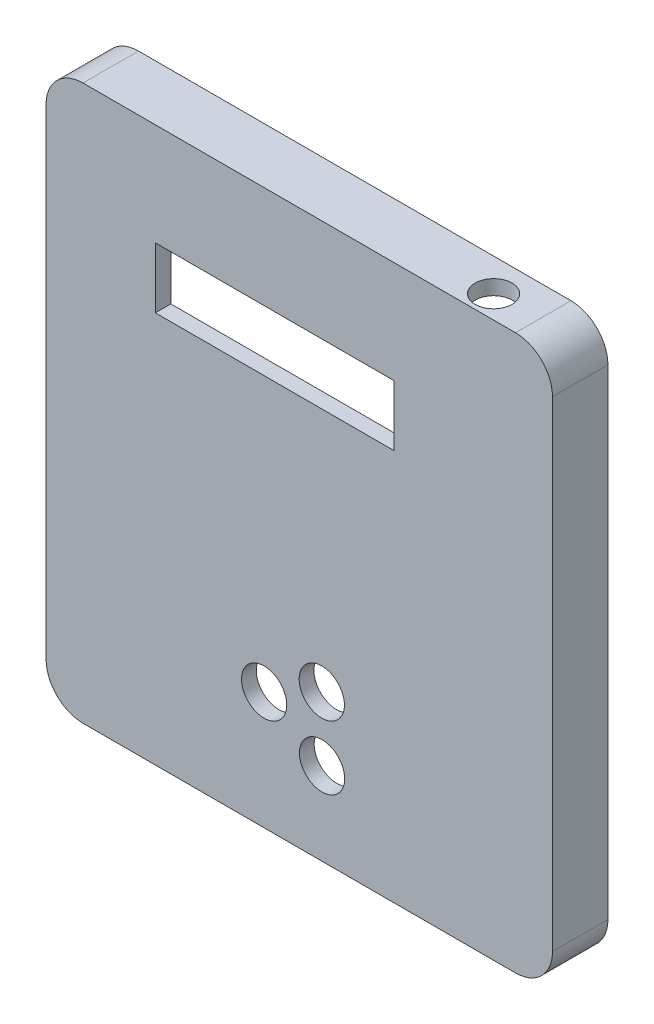
ISO-10303-21;
HEADER;
FILE_DESCRIPTION(('STEP AP214'),'2;1');
FILE_NAME('part.step','',(''),(''),'','','');
FILE_SCHEMA(('AUTOMOTIVE_DESIGN { 1 0 10303 214 1 1 1 1 }'));
ENDSEC;
DATA;
#1=APPLICATION_CONTEXT('core data for automotive mechanical design processes');
#2=APPLICATION_PROTOCOL_DEFINITION('international standard','automotive_design',2000,#1);
#3=PRODUCT_CONTEXT('',#1,'mechanical');
#4=PRODUCT('Part','Part','',(#3));
#5=PRODUCT_RELATED_PRODUCT_CATEGORY('part','',(#4));
#6=PRODUCT_DEFINITION_FORMATION('','',#4);
#7=PRODUCT_DEFINITION_CONTEXT('part definition',#1,'design');
#8=PRODUCT_DEFINITION('design','',#6,#7);
#9=PRODUCT_DEFINITION_SHAPE('','',#8);
#10=(LENGTH_UNIT() NAMED_UNIT(*) SI_UNIT(.MILLI.,.METRE.));
#11=(NAMED_UNIT(*) PLANE_ANGLE_UNIT() SI_UNIT($,.RADIAN.));
#12=(NAMED_UNIT(*) SI_UNIT($,.STERADIAN.) SOLID_ANGLE_UNIT());
#13=UNCERTAINTY_MEASURE_WITH_UNIT(LENGTH_MEASURE(1.E-05),#10,'distance_accuracy_value','');
#14=(GEOMETRIC_REPRESENTATION_CONTEXT(3) GLOBAL_UNCERTAINTY_ASSIGNED_CONTEXT((#13)) GLOBAL_UNIT_ASSIGNED_CONTEXT((#10,
#11,#12)) REPRESENTATION_CONTEXT('',''));
#15=CARTESIAN_POINT('',(0.,0.,0.));
#16=DIRECTION('',(0.,0.,1.));
#17=DIRECTION('',(1.,0.,0.));
#18=AXIS2_PLACEMENT_3D('',#15,#16,#17);
#19=CARTESIAN_POINT('',(0.,0.,0.));
#20=DIRECTION('',(0.,0.,1.));
#21=DIRECTION('',(1.,0.,0.));
#22=AXIS2_PLACEMENT_3D('',#19,#20,#21);
#23=PLANE('',#22);
#24=CARTESIAN_POINT('',(-58.5,-65.,0.));
#25=DIRECTION('',(0.,0.,1.));
#26=DIRECTION('',(1.,0.,0.));
#27=AXIS2_PLACEMENT_3D('',#24,#25,#26);
#28=CIRCLE('',#27,10.);
#29=CARTESIAN_POINT('',(-58.5,-75.,0.));
#30=VERTEX_POINT('',#29);
#31=CARTESIAN_POINT('',(-68.5,-64.9999999999999,0.));
#32=VERTEX_POINT('',#31);
#33=EDGE_CURVE('E39',#30,#32,#28,.F.);
#34=ORIENTED_EDGE('',*,*,#33,.T.);
#35=DIRECTION('',(0.,1.,0.));
#36=VECTOR('',#35,1.);
#37=CARTESIAN_POINT('',(-68.5,-64.9999999999999,0.));
#38=LINE('',#37,#36);
#39=CARTESIAN_POINT('',(-68.5,64.9999999999999,0.));
#40=VERTEX_POINT('',#39);
#41=EDGE_CURVE('E393',#32,#40,#38,.T.);
#42=ORIENTED_EDGE('',*,*,#41,.T.);
#43=CARTESIAN_POINT('',(-58.5,65.,0.));
#44=DIRECTION('',(0.,0.,1.));
#45=DIRECTION('',(1.,0.,0.));
#46=AXIS2_PLACEMENT_3D('',#43,#44,#45);
#47=CIRCLE('',#46,9.99999999999999);
#48=CARTESIAN_POINT('',(-58.5,75.,0.));
#49=VERTEX_POINT('',#48);
#50=EDGE_CURVE('E391',#40,#49,#47,.F.);
#51=ORIENTED_EDGE('',*,*,#50,.T.);
#52=DIRECTION('',(1.,0.,0.));
#53=VECTOR('',#52,1.);
#54=CARTESIAN_POINT('',(58.4999999999999,75.,0.));
#55=LINE('',#54,#53);
#56=CARTESIAN_POINT('',(58.4999999999999,75.,0.));
#57=VERTEX_POINT('',#56);
#58=EDGE_CURVE('E388',#49,#57,#55,.T.);
#59=ORIENTED_EDGE('',*,*,#58,.T.);
#60=CARTESIAN_POINT('',(58.5,65.,0.));
#61=DIRECTION('',(0.,0.,1.));
#62=DIRECTION('',(1.,0.,0.));
#63=AXIS2_PLACEMENT_3D('',#60,#61,#62);
#64=CIRCLE('',#63,9.99999999999999);
#65=CARTESIAN_POINT('',(68.5,65.,0.));
#66=VERTEX_POINT('',#65);
#67=EDGE_CURVE('E385',#57,#66,#64,.F.);
#68=ORIENTED_EDGE('',*,*,#67,.T.);
#69=DIRECTION('',(0.,-1.,0.));
#70=VECTOR('',#69,1.);
#71=CARTESIAN_POINT('',(68.5,-64.9999999999999,0.));
#72=LINE('',#71,#70);
#73=CARTESIAN_POINT('',(68.5,-65.,0.));
#74=VERTEX_POINT('',#73);
#75=EDGE_CURVE('E382',#66,#74,#72,.T.);
#76=ORIENTED_EDGE('',*,*,#75,.T.);
#77=CARTESIAN_POINT('',(58.5,-65.,0.));
#78=DIRECTION('',(0.,0.,1.));
#79=DIRECTION('',(1.,0.,0.));
#80=AXIS2_PLACEMENT_3D('',#77,#78,#79);
#81=CIRCLE('',#80,9.99999999999999);
#82=CARTESIAN_POINT('',(58.4999999999999,-75.,0.));
#83=VERTEX_POINT('',#82);
#84=EDGE_CURVE('E44',#74,#83,#81,.F.);
#85=ORIENTED_EDGE('',*,*,#84,.T.);
#86=DIRECTION('',(-1.,0.,0.));
#87=VECTOR('',#86,1.);
#88=CARTESIAN_POINT('',(58.4999999999999,-75.,0.));
#89=LINE('',#88,#87);
#90=EDGE_CURVE('E11',#83,#30,#89,.T.);
#91=ORIENTED_EDGE('',*,*,#90,.T.);
#92=EDGE_LOOP('',(#34,#42,#51,#59,#68,#76,#85,#91));
#93=FACE_BOUND('',#92,.T.);
#94=CARTESIAN_POINT('',(58.5,-65.,0.));
#95=DIRECTION('',(0.,0.,1.));
#96=DIRECTION('',(1.,0.,0.));
#97=AXIS2_PLACEMENT_3D('',#94,#95,#96);
#98=CIRCLE('',#97,5.99999999999999);
#99=CARTESIAN_POINT('',(64.5,-65.,0.));
#100=VERTEX_POINT('',#99);
#101=CARTESIAN_POINT('',(58.4999999999999,-71.,0.));
#102=VERTEX_POINT('',#101);
#103=EDGE_CURVE('E351',#100,#102,#98,.F.);
#104=ORIENTED_EDGE('',*,*,#103,.F.);
#105=DIRECTION('',(0.,-1.,0.));
#106=VECTOR('',#105,1.);
#107=CARTESIAN_POINT('',(64.5,-64.9999999999999,0.));
#108=LINE('',#107,#106);
#109=CARTESIAN_POINT('',(64.5,65.,0.));
#110=VERTEX_POINT('',#109);
#111=EDGE_CURVE('E367',#110,#100,#108,.T.);
#112=ORIENTED_EDGE('',*,*,#111,.F.);
#113=CARTESIAN_POINT('',(58.5,65.,0.));
#114=DIRECTION('',(0.,0.,1.));
#115=DIRECTION('',(1.,0.,0.));
#116=AXIS2_PLACEMENT_3D('',#113,#114,#115);
#117=CIRCLE('',#116,5.99999999999999);
#118=CARTESIAN_POINT('',(58.5,71.,0.));
#119=VERTEX_POINT('',#118);
#120=EDGE_CURVE('E369',#119,#110,#117,.F.);
#121=ORIENTED_EDGE('',*,*,#120,.F.);
#122=DIRECTION('',(1.,0.,0.));
#123=VECTOR('',#122,1.);
#124=CARTESIAN_POINT('',(58.4999999999999,71.,0.));
#125=LINE('',#124,#123);
#126=CARTESIAN_POINT('',(-58.5,71.,0.));
#127=VERTEX_POINT('',#126);
#128=EDGE_CURVE('E371',#127,#119,#125,.T.);
#129=ORIENTED_EDGE('',*,*,#128,.F.);
#130=CARTESIAN_POINT('',(-58.5,65.,0.));
#131=DIRECTION('',(0.,0.,1.));
#132=DIRECTION('',(1.,0.,0.));
#133=AXIS2_PLACEMENT_3D('',#130,#131,#132);
#134=CIRCLE('',#133,5.99999999999999);
#135=CARTESIAN_POINT('',(-64.5,65.,0.));
#136=VERTEX_POINT('',#135);
#137=EDGE_CURVE('E373',#136,#127,#134,.F.);
#138=ORIENTED_EDGE('',*,*,#137,.F.);
#139=DIRECTION('',(0.,1.,0.));
#140=VECTOR('',#139,1.);
#141=CARTESIAN_POINT('',(-64.5,-64.9999999999999,0.));
#142=LINE('',#141,#140);
#143=CARTESIAN_POINT('',(-64.5,-64.9999999999999,0.));
#144=VERTEX_POINT('',#143);
#145=EDGE_CURVE('E375',#144,#136,#142,.T.);
#146=ORIENTED_EDGE('',*,*,#145,.F.);
#147=CARTESIAN_POINT('',(-58.5,-65.,0.));
#148=DIRECTION('',(0.,0.,1.));
#149=DIRECTION('',(1.,0.,0.));
#150=AXIS2_PLACEMENT_3D('',#147,#148,#149);
#151=CIRCLE('',#150,6.00000000000001);
#152=CARTESIAN_POINT('',(-58.5,-71.,0.));
#153=VERTEX_POINT('',#152);
#154=EDGE_CURVE('E377',#153,#144,#151,.F.);
#155=ORIENTED_EDGE('',*,*,#154,.F.);
#156=DIRECTION('',(-1.,0.,0.));
#157=VECTOR('',#156,1.);
#158=CARTESIAN_POINT('',(58.4999999999999,-71.,0.));
#159=LINE('',#158,#157);
#160=EDGE_CURVE('E379',#102,#153,#159,.T.);
#161=ORIENTED_EDGE('',*,*,#160,.F.);
#162=EDGE_LOOP('',(#104,#112,#121,#129,#138,#146,#155,#161));
#163=FACE_BOUND('',#162,.T.);
#164=ADVANCED_FACE('F36',(#93,#163),#23,.F.);
#165=CARTESIAN_POINT('',(-6.686,39.143,10.825));
#166=DIRECTION('',(0.,0.,1.));
#167=DIRECTION('',(1.,0.,0.));
#168=AXIS2_PLACEMENT_3D('',#165,#166,#167);
#169=PLANE('',#168);
#170=DIRECTION('',(0.,1.,0.));
#171=VECTOR('',#170,1.);
#172=CARTESIAN_POINT('',(-42.936,47.343,10.825));
#173=LINE('',#172,#171);
#174=CARTESIAN_POINT('',(-42.936,26.943,10.825));
#175=VERTEX_POINT('',#174);
#176=CARTESIAN_POINT('',(-42.936,51.343,10.825));
#177=VERTEX_POINT('',#176);
#178=EDGE_CURVE('E285',#175,#177,#173,.T.);
#179=ORIENTED_EDGE('',*,*,#178,.T.);
#180=DIRECTION('',(1.,0.,0.));
#181=VECTOR('',#180,1.);
#182=CARTESIAN_POINT('',(-38.936,51.343,10.825));
#183=LINE('',#182,#181);
#184=CARTESIAN_POINT('',(29.564,51.343,10.825));
#185=VERTEX_POINT('',#184);
#186=EDGE_CURVE('E288',#177,#185,#183,.T.);
#187=ORIENTED_EDGE('',*,*,#186,.T.);
#188=DIRECTION('',(0.,-1.,0.));
#189=VECTOR('',#188,1.);
#190=CARTESIAN_POINT('',(29.564,47.343,10.825));
#191=LINE('',#190,#189);
#192=CARTESIAN_POINT('',(29.564,26.943,10.825));
#193=VERTEX_POINT('',#192);
#194=EDGE_CURVE('E278',#185,#193,#191,.T.);
#195=ORIENTED_EDGE('',*,*,#194,.T.);
#196=DIRECTION('',(-1.,0.,0.));
#197=VECTOR('',#196,1.);
#198=CARTESIAN_POINT('',(-38.936,26.943,10.825));
#199=LINE('',#198,#197);
#200=EDGE_CURVE('E287',#193,#175,#199,.T.);
#201=ORIENTED_EDGE('',*,*,#200,.T.);
#202=EDGE_LOOP('',(#179,#187,#195,#201));
#203=FACE_BOUND('',#202,.T.);
#204=DIRECTION('',(-1.,0.,0.));
#205=VECTOR('',#204,1.);
#206=CARTESIAN_POINT('',(-38.936,30.943,10.825));
#207=LINE('',#206,#205);
#208=CARTESIAN_POINT('',(25.564,30.943,10.825));
#209=VERTEX_POINT('',#208);
#210=CARTESIAN_POINT('',(-38.936,30.943,10.825));
#211=VERTEX_POINT('',#210);
#212=EDGE_CURVE('E302',#209,#211,#207,.T.);
#213=ORIENTED_EDGE('',*,*,#212,.F.);
#214=DIRECTION('',(0.,-1.,0.));
#215=VECTOR('',#214,1.);
#216=CARTESIAN_POINT('',(25.564,47.343,10.825));
#217=LINE('',#216,#215);
#218=CARTESIAN_POINT('',(25.564,47.343,10.825));
#219=VERTEX_POINT('',#218);
#220=EDGE_CURVE('E292',#219,#209,#217,.T.);
#221=ORIENTED_EDGE('',*,*,#220,.F.);
#222=DIRECTION('',(1.,0.,0.));
#223=VECTOR('',#222,1.);
#224=CARTESIAN_POINT('',(-38.936,47.343,10.825));
#225=LINE('',#224,#223);
#226=CARTESIAN_POINT('',(-38.936,47.343,10.825));
#227=VERTEX_POINT('',#226);
#228=EDGE_CURVE('E295',#227,#219,#225,.T.);
#229=ORIENTED_EDGE('',*,*,#228,.F.);
#230=DIRECTION('',(0.,1.,0.));
#231=VECTOR('',#230,1.);
#232=CARTESIAN_POINT('',(-38.936,47.343,10.825));
#233=LINE('',#232,#231);
#234=EDGE_CURVE('E299',#211,#227,#233,.T.);
#235=ORIENTED_EDGE('',*,*,#234,.F.);
#236=EDGE_LOOP('',(#213,#221,#229,#235));
#237=FACE_BOUND('',#236,.T.);
#238=ADVANCED_FACE('F436',(#203,#237),#169,.F.);
#239=CARTESIAN_POINT('',(25.564,47.343,-55.7273102529131));
#240=DIRECTION('',(1.,0.,0.));
#241=DIRECTION('',(0.,0.,-1.));
#242=AXIS2_PLACEMENT_3D('',#239,#240,#241);
#243=PLANE('',#242);
#244=ORIENTED_EDGE('',*,*,#220,.T.);
#245=DIRECTION('',(0.,0.,1.));
#246=VECTOR('',#245,1.);
#247=CARTESIAN_POINT('',(25.564,30.943,-55.7273102529131));
#248=LINE('',#247,#246);
#249=CARTESIAN_POINT('',(25.564,30.943,15.));
#250=VERTEX_POINT('',#249);
#251=EDGE_CURVE('E318',#209,#250,#248,.T.);
#252=ORIENTED_EDGE('',*,*,#251,.T.);
#253=DIRECTION('',(0.,1.,0.));
#254=VECTOR('',#253,1.);
#255=CARTESIAN_POINT('',(25.564,47.343,15.));
#256=LINE('',#255,#254);
#257=CARTESIAN_POINT('',(25.564,47.343,15.));
#258=VERTEX_POINT('',#257);
#259=EDGE_CURVE('E308',#250,#258,#256,.T.);
#260=ORIENTED_EDGE('',*,*,#259,.T.);
#261=DIRECTION('',(0.,0.,1.));
#262=VECTOR('',#261,1.);
#263=CARTESIAN_POINT('',(25.564,47.343,-55.7273102529131));
#264=LINE('',#263,#262);
#265=EDGE_CURVE('E316',#219,#258,#264,.T.);
#266=ORIENTED_EDGE('',*,*,#265,.F.);
#267=EDGE_LOOP('',(#244,#252,#260,#266));
#268=FACE_BOUND('',#267,.T.);
#269=ADVANCED_FACE('F440',(#268),#243,.F.);
#270=CARTESIAN_POINT('',(-38.936,47.343,-55.7273102529131));
#271=DIRECTION('',(0.,1.,0.));
#272=DIRECTION('',(0.,0.,1.));
#273=AXIS2_PLACEMENT_3D('',#270,#271,#272);
#274=PLANE('',#273);
#275=ORIENTED_EDGE('',*,*,#228,.T.);
#276=ORIENTED_EDGE('',*,*,#265,.T.);
#277=DIRECTION('',(-1.,0.,0.));
#278=VECTOR('',#277,1.);
#279=CARTESIAN_POINT('',(-38.936,47.343,15.));
#280=LINE('',#279,#278);
#281=CARTESIAN_POINT('',(-38.936,47.343,15.));
#282=VERTEX_POINT('',#281);
#283=EDGE_CURVE('E311',#258,#282,#280,.T.);
#284=ORIENTED_EDGE('',*,*,#283,.T.);
#285=DIRECTION('',(0.,0.,1.));
#286=VECTOR('',#285,1.);
#287=CARTESIAN_POINT('',(-38.936,47.343,-55.7273102529131));
#288=LINE('',#287,#286);
#289=EDGE_CURVE('E296',#227,#282,#288,.T.);
#290=ORIENTED_EDGE('',*,*,#289,.F.);
#291=EDGE_LOOP('',(#275,#276,#284,#290));
#292=FACE_BOUND('',#291,.T.);
#293=ADVANCED_FACE('F446',(#292),#274,.F.);
#294=CARTESIAN_POINT('',(-38.936,47.343,-55.7273102529131));
#295=DIRECTION('',(-1.,0.,0.));
#296=DIRECTION('',(0.,0.,1.));
#297=AXIS2_PLACEMENT_3D('',#294,#295,#296);
#298=PLANE('',#297);
#299=ORIENTED_EDGE('',*,*,#234,.T.);
#300=ORIENTED_EDGE('',*,*,#289,.T.);
#301=DIRECTION('',(0.,-1.,0.));
#302=VECTOR('',#301,1.);
#303=CARTESIAN_POINT('',(-38.936,47.343,15.));
#304=LINE('',#303,#302);
#305=CARTESIAN_POINT('',(-38.936,30.943,15.));
#306=VERTEX_POINT('',#305);
#307=EDGE_CURVE('E303',#282,#306,#304,.T.);
#308=ORIENTED_EDGE('',*,*,#307,.T.);
#309=DIRECTION('',(0.,0.,1.));
#310=VECTOR('',#309,1.);
#311=CARTESIAN_POINT('',(-38.936,30.943,-55.7273102529131));
#312=LINE('',#311,#310);
#313=EDGE_CURVE('E314',#211,#306,#312,.T.);
#314=ORIENTED_EDGE('',*,*,#313,.F.);
#315=EDGE_LOOP('',(#299,#300,#308,#314));
#316=FACE_BOUND('',#315,.T.);
#317=ADVANCED_FACE('F503',(#316),#298,.F.);
#318=CARTESIAN_POINT('',(-38.936,30.943,-55.7273102529131));
#319=DIRECTION('',(0.,-1.,0.));
#320=DIRECTION('',(0.,0.,-1.));
#321=AXIS2_PLACEMENT_3D('',#318,#319,#320);
#322=PLANE('',#321);
#323=ORIENTED_EDGE('',*,*,#212,.T.);
#324=ORIENTED_EDGE('',*,*,#313,.T.);
#325=DIRECTION('',(1.,0.,0.));
#326=VECTOR('',#325,1.);
#327=CARTESIAN_POINT('',(-38.936,30.943,15.));
#328=LINE('',#327,#326);
#329=EDGE_CURVE('E305',#306,#250,#328,.T.);
#330=ORIENTED_EDGE('',*,*,#329,.T.);
#331=ORIENTED_EDGE('',*,*,#251,.F.);
#332=EDGE_LOOP('',(#323,#324,#330,#331));
#333=FACE_BOUND('',#332,.T.);
#334=ADVANCED_FACE('F506',(#333),#322,.F.);
#335=CARTESIAN_POINT('',(46.3962,71.,8.825));
#336=DIRECTION('',(0.,1.,0.));
#337=DIRECTION('',(-1.,0.,0.));
#338=AXIS2_PLACEMENT_3D('',#335,#336,#337);
#339=PLANE('',#338);
#340=CARTESIAN_POINT('',(46.3962,71.,8.825));
#341=DIRECTION('',(0.,1.,0.));
#342=DIRECTION('',(-1.,0.,0.));
#343=AXIS2_PLACEMENT_3D('',#340,#341,#342);
#344=CIRCLE('',#343,5.);
#345=CARTESIAN_POINT('',(41.8940477369151,71.,11.));
#346=VERTEX_POINT('',#345);
#347=CARTESIAN_POINT('',(50.8983522630848,71.,11.));
#348=VERTEX_POINT('',#347);
#349=EDGE_CURVE('E203',#346,#348,#344,.T.);
#350=ORIENTED_EDGE('',*,*,#349,.T.);
#351=DIRECTION('',(-1.,0.,0.));
#352=VECTOR('',#351,1.);
#353=CARTESIAN_POINT('',(58.4999999999999,71.,11.));
#354=LINE('',#353,#352);
#355=EDGE_CURVE('E200',#348,#346,#354,.T.);
#356=ORIENTED_EDGE('',*,*,#355,.T.);
#357=EDGE_LOOP('',(#350,#356));
#358=FACE_BOUND('',#357,.T.);
#359=ADVANCED_FACE('F202',(#358),#339,.T.);
#360=CARTESIAN_POINT('',(-42.936,47.343,-55.7273102529131));
#361=DIRECTION('',(-1.,0.,0.));
#362=DIRECTION('',(0.,0.,1.));
#363=AXIS2_PLACEMENT_3D('',#360,#361,#362);
#364=PLANE('',#363);
#365=ORIENTED_EDGE('',*,*,#178,.F.);
#366=DIRECTION('',(0.,0.,1.));
#367=VECTOR('',#366,1.);
#368=CARTESIAN_POINT('',(-42.936,26.943,-55.7273102529131));
#369=LINE('',#368,#367);
#370=CARTESIAN_POINT('',(-42.936,26.943,11.));
#371=VERTEX_POINT('',#370);
#372=EDGE_CURVE('E273',#175,#371,#369,.T.);
#373=ORIENTED_EDGE('',*,*,#372,.T.);
#374=DIRECTION('',(0.,-1.,0.));
#375=VECTOR('',#374,1.);
#376=CARTESIAN_POINT('',(-42.936,47.343,11.));
#377=LINE('',#376,#375);
#378=CARTESIAN_POINT('',(-42.936,51.343,11.));
#379=VERTEX_POINT('',#378);
#380=EDGE_CURVE('E217',#379,#371,#377,.T.);
#381=ORIENTED_EDGE('',*,*,#380,.F.);
#382=DIRECTION('',(0.,0.,1.));
#383=VECTOR('',#382,1.);
#384=CARTESIAN_POINT('',(-42.936,51.343,-55.7273102529131));
#385=LINE('',#384,#383);
#386=EDGE_CURVE('E276',#177,#379,#385,.T.);
#387=ORIENTED_EDGE('',*,*,#386,.F.);
#388=EDGE_LOOP('',(#365,#373,#381,#387));
#389=FACE_BOUND('',#388,.T.);
#390=ADVANCED_FACE('F485',(#389),#364,.T.);
#391=CARTESIAN_POINT('',(-38.936,51.343,-55.7273102529131));
#392=DIRECTION('',(0.,1.,0.));
#393=DIRECTION('',(0.,0.,1.));
#394=AXIS2_PLACEMENT_3D('',#391,#392,#393);
#395=PLANE('',#394);
#396=ORIENTED_EDGE('',*,*,#186,.F.);
#397=ORIENTED_EDGE('',*,*,#386,.T.);
#398=DIRECTION('',(-1.,0.,0.));
#399=VECTOR('',#398,1.);
#400=CARTESIAN_POINT('',(-38.936,51.343,11.));
#401=LINE('',#400,#399);
#402=CARTESIAN_POINT('',(29.564,51.343,11.));
#403=VERTEX_POINT('',#402);
#404=EDGE_CURVE('E270',#403,#379,#401,.T.);
#405=ORIENTED_EDGE('',*,*,#404,.F.);
#406=DIRECTION('',(0.,0.,1.));
#407=VECTOR('',#406,1.);
#408=CARTESIAN_POINT('',(29.564,51.343,-55.7273102529131));
#409=LINE('',#408,#407);
#410=EDGE_CURVE('E279',#185,#403,#409,.T.);
#411=ORIENTED_EDGE('',*,*,#410,.F.);
#412=EDGE_LOOP('',(#396,#397,#405,#411));
#413=FACE_BOUND('',#412,.T.);
#414=ADVANCED_FACE('F488',(#413),#395,.T.);
#415=CARTESIAN_POINT('',(29.564,47.343,-55.7273102529131));
#416=DIRECTION('',(1.,0.,0.));
#417=DIRECTION('',(0.,0.,-1.));
#418=AXIS2_PLACEMENT_3D('',#415,#416,#417);
#419=PLANE('',#418);
#420=ORIENTED_EDGE('',*,*,#194,.F.);
#421=ORIENTED_EDGE('',*,*,#410,.T.);
#422=DIRECTION('',(0.,1.,0.));
#423=VECTOR('',#422,1.);
#424=CARTESIAN_POINT('',(29.564,47.343,11.));
#425=LINE('',#424,#423);
#426=CARTESIAN_POINT('',(29.564,26.943,11.));
#427=VERTEX_POINT('',#426);
#428=EDGE_CURVE('E268',#427,#403,#425,.T.);
#429=ORIENTED_EDGE('',*,*,#428,.F.);
#430=DIRECTION('',(0.,0.,1.));
#431=VECTOR('',#430,1.);
#432=CARTESIAN_POINT('',(29.564,26.943,-55.7273102529131));
#433=LINE('',#432,#431);
#434=EDGE_CURVE('E282',#193,#427,#433,.T.);
#435=ORIENTED_EDGE('',*,*,#434,.F.);
#436=EDGE_LOOP('',(#420,#421,#429,#435));
#437=FACE_BOUND('',#436,.T.);
#438=ADVANCED_FACE('F492',(#437),#419,.T.);
#439=CARTESIAN_POINT('',(-38.936,26.943,-55.7273102529131));
#440=DIRECTION('',(0.,-1.,0.));
#441=DIRECTION('',(0.,0.,-1.));
#442=AXIS2_PLACEMENT_3D('',#439,#440,#441);
#443=PLANE('',#442);
#444=ORIENTED_EDGE('',*,*,#200,.F.);
#445=ORIENTED_EDGE('',*,*,#434,.T.);
#446=DIRECTION('',(1.,0.,0.));
#447=VECTOR('',#446,1.);
#448=CARTESIAN_POINT('',(-38.936,26.943,11.));
#449=LINE('',#448,#447);
#450=EDGE_CURVE('E265',#371,#427,#449,.T.);
#451=ORIENTED_EDGE('',*,*,#450,.F.);
#452=ORIENTED_EDGE('',*,*,#372,.F.);
#453=EDGE_LOOP('',(#444,#445,#451,#452));
#454=FACE_BOUND('',#453,.T.);
#455=ADVANCED_FACE('F496',(#454),#443,.T.);
#456=CARTESIAN_POINT('',(6.0878,-35.3806,11.));
#457=DIRECTION('',(0.,0.,1.));
#458=DIRECTION('',(1.,0.,0.));
#459=AXIS2_PLACEMENT_3D('',#456,#457,#458);
#460=CYLINDRICAL_SURFACE('',#459,6.125);
#461=CARTESIAN_POINT('',(6.0878,-35.3806,11.));
#462=DIRECTION('',(0.,0.,1.));
#463=DIRECTION('',(1.,0.,0.));
#464=AXIS2_PLACEMENT_3D('',#461,#462,#463);
#465=CIRCLE('',#464,6.125);
#466=CARTESIAN_POINT('',(12.2128,-35.3806,11.));
#467=VERTEX_POINT('',#466);
#468=EDGE_CURVE('E722',#467,#467,#465,.T.);
#469=ORIENTED_EDGE('',*,*,#468,.F.);
#470=EDGE_LOOP('',(#469));
#471=FACE_BOUND('',#470,.T.);
#472=CARTESIAN_POINT('',(6.0878,-35.3806,15.));
#473=DIRECTION('',(0.,0.,1.));
#474=DIRECTION('',(1.,0.,0.));
#475=AXIS2_PLACEMENT_3D('',#472,#473,#474);
#476=CIRCLE('',#475,6.125);
#477=CARTESIAN_POINT('',(12.2128,-35.3806,15.));
#478=VERTEX_POINT('',#477);
#479=EDGE_CURVE('E725',#478,#478,#476,.T.);
#480=ORIENTED_EDGE('',*,*,#479,.T.);
#481=EDGE_LOOP('',(#480));
#482=FACE_BOUND('',#481,.T.);
#483=ADVANCED_FACE('F500',(#471,#482),#460,.F.);
#484=CARTESIAN_POINT('',(-9.5144,-43.1896,11.));
#485=DIRECTION('',(0.,0.,1.));
#486=DIRECTION('',(1.,0.,0.));
#487=AXIS2_PLACEMENT_3D('',#484,#485,#486);
#488=CYLINDRICAL_SURFACE('',#487,6.125);
#489=CARTESIAN_POINT('',(-9.5144,-43.1896,11.));
#490=DIRECTION('',(0.,0.,1.));
#491=DIRECTION('',(1.,0.,0.));
#492=AXIS2_PLACEMENT_3D('',#489,#490,#491);
#493=CIRCLE('',#492,6.125);
#494=CARTESIAN_POINT('',(-3.3894,-43.1896,11.));
#495=VERTEX_POINT('',#494);
#496=EDGE_CURVE('E727',#495,#495,#493,.T.);
#497=ORIENTED_EDGE('',*,*,#496,.F.);
#498=EDGE_LOOP('',(#497));
#499=FACE_BOUND('',#498,.T.);
#500=CARTESIAN_POINT('',(-9.5144,-43.1896,15.));
#501=DIRECTION('',(0.,0.,1.));
#502=DIRECTION('',(1.,0.,0.));
#503=AXIS2_PLACEMENT_3D('',#500,#501,#502);
#504=CIRCLE('',#503,6.125);
#505=CARTESIAN_POINT('',(-3.3894,-43.1896,15.));
#506=VERTEX_POINT('',#505);
#507=EDGE_CURVE('E731',#506,#506,#504,.T.);
#508=ORIENTED_EDGE('',*,*,#507,.T.);
#509=EDGE_LOOP('',(#508));
#510=FACE_BOUND('',#509,.T.);
#511=ADVANCED_FACE('F638',(#499,#510),#488,.F.);
#512=CARTESIAN_POINT('',(6.16099999999999,-52.6348,11.));
#513=DIRECTION('',(0.,0.,1.));
#514=DIRECTION('',(1.,0.,0.));
#515=AXIS2_PLACEMENT_3D('',#512,#513,#514);
#516=CYLINDRICAL_SURFACE('',#515,6.125);
#517=CARTESIAN_POINT('',(6.16099999999999,-52.6348,11.));
#518=DIRECTION('',(0.,0.,1.));
#519=DIRECTION('',(1.,0.,0.));
#520=AXIS2_PLACEMENT_3D('',#517,#518,#519);
#521=CIRCLE('',#520,6.125);
#522=CARTESIAN_POINT('',(12.286,-52.6348,11.));
#523=VERTEX_POINT('',#522);
#524=EDGE_CURVE('E760',#523,#523,#521,.T.);
#525=ORIENTED_EDGE('',*,*,#524,.F.);
#526=EDGE_LOOP('',(#525));
#527=FACE_BOUND('',#526,.T.);
#528=CARTESIAN_POINT('',(6.16099999999999,-52.6348,15.));
#529=DIRECTION('',(0.,0.,1.));
#530=DIRECTION('',(1.,0.,0.));
#531=AXIS2_PLACEMENT_3D('',#528,#529,#530);
#532=CIRCLE('',#531,6.125);
#533=CARTESIAN_POINT('',(12.286,-52.6348,15.));
#534=VERTEX_POINT('',#533);
#535=EDGE_CURVE('E757',#534,#534,#532,.T.);
#536=ORIENTED_EDGE('',*,*,#535,.T.);
#537=EDGE_LOOP('',(#536));
#538=FACE_BOUND('',#537,.T.);
#539=ADVANCED_FACE('F518',(#527,#538),#516,.F.);
#540=CARTESIAN_POINT('',(-68.5,-64.9999999999999,-25.));
#541=DIRECTION('',(-1.,0.,0.));
#542=DIRECTION('',(0.,0.,1.));
#543=AXIS2_PLACEMENT_3D('',#540,#541,#542);
#544=PLANE('',#543);
#545=ORIENTED_EDGE('',*,*,#41,.F.);
#546=DIRECTION('',(0.,0.,1.));
#547=VECTOR('',#546,1.);
#548=CARTESIAN_POINT('',(-68.5,-64.9999999999999,-25.));
#549=LINE('',#548,#547);
#550=CARTESIAN_POINT('',(-68.5,-64.9999999999999,15.));
#551=VERTEX_POINT('',#550);
#552=EDGE_CURVE('E349',#32,#551,#549,.T.);
#553=ORIENTED_EDGE('',*,*,#552,.T.);
#554=DIRECTION('',(0.,-1.,0.));
#555=VECTOR('',#554,1.);
#556=CARTESIAN_POINT('',(-68.5,-64.9999999999999,15.));
#557=LINE('',#556,#555);
#558=CARTESIAN_POINT('',(-68.5,64.9999999999999,15.));
#559=VERTEX_POINT('',#558);
#560=EDGE_CURVE('E345',#559,#551,#557,.T.);
#561=ORIENTED_EDGE('',*,*,#560,.F.);
#562=DIRECTION('',(0.,0.,1.));
#563=VECTOR('',#562,1.);
#564=CARTESIAN_POINT('',(-68.5,64.9999999999999,-25.));
#565=LINE('',#564,#563);
#566=EDGE_CURVE('E352',#40,#559,#565,.T.);
#567=ORIENTED_EDGE('',*,*,#566,.F.);
#568=EDGE_LOOP('',(#545,#553,#561,#567));
#569=FACE_BOUND('',#568,.T.);
#570=ADVANCED_FACE('F403',(#569),#544,.T.);
#571=CARTESIAN_POINT('',(-58.5,-65.,-25.));
#572=DIRECTION('',(0.,0.,1.));
#573=DIRECTION('',(1.,0.,0.));
#574=AXIS2_PLACEMENT_3D('',#571,#572,#573);
#575=CYLINDRICAL_SURFACE('',#574,6.00000000000001);
#576=DIRECTION('',(0.,0.,1.));
#577=VECTOR('',#576,1.);
#578=CARTESIAN_POINT('',(-58.5,-71.,-25.));
#579=LINE('',#578,#577);
#580=CARTESIAN_POINT('',(-58.5,-71.,11.));
#581=VERTEX_POINT('',#580);
#582=EDGE_CURVE('E241',#153,#581,#579,.T.);
#583=ORIENTED_EDGE('',*,*,#582,.F.);
#584=ORIENTED_EDGE('',*,*,#154,.T.);
#585=DIRECTION('',(0.,0.,1.));
#586=VECTOR('',#585,1.);
#587=CARTESIAN_POINT('',(-64.5,-64.9999999999999,-25.));
#588=LINE('',#587,#586);
#589=CARTESIAN_POINT('',(-64.5,-64.9999999999999,11.));
#590=VERTEX_POINT('',#589);
#591=EDGE_CURVE('E247',#144,#590,#588,.T.);
#592=ORIENTED_EDGE('',*,*,#591,.T.);
#593=CARTESIAN_POINT('',(-58.5,-65.,11.));
#594=DIRECTION('',(0.,0.,-1.));
#595=DIRECTION('',(-1.,0.,0.));
#596=AXIS2_PLACEMENT_3D('',#593,#594,#595);
#597=CIRCLE('',#596,6.00000000000001);
#598=EDGE_CURVE('E264',#590,#581,#597,.F.);
#599=ORIENTED_EDGE('',*,*,#598,.T.);
#600=EDGE_LOOP('',(#583,#584,#592,#599));
#601=FACE_BOUND('',#600,.T.);
#602=ADVANCED_FACE('F453',(#601),#575,.F.);
#603=CARTESIAN_POINT('',(-64.5,-64.9999999999999,-25.));
#604=DIRECTION('',(-1.,0.,0.));
#605=DIRECTION('',(0.,0.,1.));
#606=AXIS2_PLACEMENT_3D('',#603,#604,#605);
#607=PLANE('',#606);
#608=ORIENTED_EDGE('',*,*,#591,.F.);
#609=ORIENTED_EDGE('',*,*,#145,.T.);
#610=DIRECTION('',(0.,0.,1.));
#611=VECTOR('',#610,1.);
#612=CARTESIAN_POINT('',(-64.5,65.,-25.));
#613=LINE('',#612,#611);
#614=CARTESIAN_POINT('',(-64.5,65.,11.));
#615=VERTEX_POINT('',#614);
#616=EDGE_CURVE('E244',#136,#615,#613,.T.);
#617=ORIENTED_EDGE('',*,*,#616,.T.);
#618=DIRECTION('',(0.,-1.,0.));
#619=VECTOR('',#618,1.);
#620=CARTESIAN_POINT('',(-64.5,-64.9999999999999,11.));
#621=LINE('',#620,#619);
#622=EDGE_CURVE('E236',#615,#590,#621,.T.);
#623=ORIENTED_EDGE('',*,*,#622,.T.);
#624=EDGE_LOOP('',(#608,#609,#617,#623));
#625=FACE_BOUND('',#624,.T.);
#626=ADVANCED_FACE('F456',(#625),#607,.F.);
#627=CARTESIAN_POINT('',(46.3962,71.,8.825));
#628=DIRECTION('',(0.,1.,0.));
#629=DIRECTION('',(-1.,0.,0.));
#630=AXIS2_PLACEMENT_3D('',#627,#628,#629);
#631=CYLINDRICAL_SURFACE('',#630,5.);
#632=ORIENTED_EDGE('',*,*,#349,.F.);
#633=EDGE_CURVE('E216',#348,#346,#344,.T.);
#634=ORIENTED_EDGE('',*,*,#633,.F.);
#635=EDGE_LOOP('',(#632,#634));
#636=FACE_BOUND('',#635,.T.);
#637=CARTESIAN_POINT('',(46.3962,75.,8.825));
#638=DIRECTION('',(0.,1.,0.));
#639=DIRECTION('',(-1.,0.,0.));
#640=AXIS2_PLACEMENT_3D('',#637,#638,#639);
#641=CIRCLE('',#640,5.);
#642=CARTESIAN_POINT('',(41.3962,75.,8.825));
#643=VERTEX_POINT('',#642);
#644=EDGE_CURVE('E224',#643,#643,#641,.T.);
#645=ORIENTED_EDGE('',*,*,#644,.T.);
#646=EDGE_LOOP('',(#645));
#647=FACE_BOUND('',#646,.T.);
#648=ADVANCED_FACE('F214',(#636,#647),#631,.F.);
#649=CARTESIAN_POINT('',(-58.5,65.,-25.));
#650=DIRECTION('',(0.,0.,1.));
#651=DIRECTION('',(1.,0.,0.));
#652=AXIS2_PLACEMENT_3D('',#649,#650,#651);
#653=CYLINDRICAL_SURFACE('',#652,5.99999999999999);
#654=ORIENTED_EDGE('',*,*,#616,.F.);
#655=ORIENTED_EDGE('',*,*,#137,.T.);
#656=DIRECTION('',(0.,0.,1.));
#657=VECTOR('',#656,1.);
#658=CARTESIAN_POINT('',(-58.5,71.,-25.));
#659=LINE('',#658,#657);
#660=CARTESIAN_POINT('',(-58.5,71.,11.));
#661=VERTEX_POINT('',#660);
#662=EDGE_CURVE('E245',#127,#661,#659,.T.);
#663=ORIENTED_EDGE('',*,*,#662,.T.);
#664=CARTESIAN_POINT('',(-58.5,65.,11.));
#665=DIRECTION('',(0.,0.,-1.));
#666=DIRECTION('',(-1.,0.,0.));
#667=AXIS2_PLACEMENT_3D('',#664,#665,#666);
#668=CIRCLE('',#667,5.99999999999999);
#669=EDGE_CURVE('E229',#661,#615,#668,.F.);
#670=ORIENTED_EDGE('',*,*,#669,.T.);
#671=EDGE_LOOP('',(#654,#655,#663,#670));
#672=FACE_BOUND('',#671,.T.);
#673=ADVANCED_FACE('F461',(#672),#653,.F.);
#674=CARTESIAN_POINT('',(58.4999999999999,71.,-25.));
#675=DIRECTION('',(0.,1.,0.));
#676=DIRECTION('',(-1.,0.,0.));
#677=AXIS2_PLACEMENT_3D('',#674,#675,#676);
#678=PLANE('',#677);
#679=ORIENTED_EDGE('',*,*,#662,.F.);
#680=ORIENTED_EDGE('',*,*,#128,.T.);
#681=DIRECTION('',(0.,0.,1.));
#682=VECTOR('',#681,1.);
#683=CARTESIAN_POINT('',(58.5,71.,-25.));
#684=LINE('',#683,#682);
#685=CARTESIAN_POINT('',(58.5,71.,11.));
#686=VERTEX_POINT('',#685);
#687=EDGE_CURVE('E246',#119,#686,#684,.T.);
#688=ORIENTED_EDGE('',*,*,#687,.T.);
#689=EDGE_CURVE('E209',#686,#348,#354,.T.);
#690=ORIENTED_EDGE('',*,*,#689,.T.);
#691=ORIENTED_EDGE('',*,*,#633,.T.);
#692=EDGE_CURVE('E210',#346,#661,#354,.T.);
#693=ORIENTED_EDGE('',*,*,#692,.T.);
#694=EDGE_LOOP('',(#679,#680,#688,#690,#691,#693));
#695=FACE_BOUND('',#694,.T.);
#696=ADVANCED_FACE('F222',(#695),#678,.F.);
#697=CARTESIAN_POINT('',(58.5,65.,-25.));
#698=DIRECTION('',(0.,0.,1.));
#699=DIRECTION('',(1.,0.,0.));
#700=AXIS2_PLACEMENT_3D('',#697,#698,#699);
#701=CYLINDRICAL_SURFACE('',#700,5.99999999999999);
#702=ORIENTED_EDGE('',*,*,#687,.F.);
#703=ORIENTED_EDGE('',*,*,#120,.T.);
#704=DIRECTION('',(0.,0.,-1.));
#705=VECTOR('',#704,1.);
#706=CARTESIAN_POINT('',(64.5,65.,-25.));
#707=LINE('',#706,#705);
#708=CARTESIAN_POINT('',(64.5,65.,11.));
#709=VERTEX_POINT('',#708);
#710=EDGE_CURVE('E248',#110,#709,#707,.F.);
#711=ORIENTED_EDGE('',*,*,#710,.T.);
#712=CARTESIAN_POINT('',(58.5,65.,11.));
#713=DIRECTION('',(0.,0.,-1.));
#714=DIRECTION('',(-1.,0.,0.));
#715=AXIS2_PLACEMENT_3D('',#712,#713,#714);
#716=CIRCLE('',#715,5.99999999999999);
#717=EDGE_CURVE('E230',#709,#686,#716,.F.);
#718=ORIENTED_EDGE('',*,*,#717,.T.);
#719=EDGE_LOOP('',(#702,#703,#711,#718));
#720=FACE_BOUND('',#719,.T.);
#721=ADVANCED_FACE('F466',(#720),#701,.F.);
#722=CARTESIAN_POINT('',(-58.5,-65.,11.));
#723=DIRECTION('',(0.,0.,-1.));
#724=DIRECTION('',(-1.,0.,0.));
#725=AXIS2_PLACEMENT_3D('',#722,#723,#724);
#726=PLANE('',#725);
#727=ORIENTED_EDGE('',*,*,#524,.T.);
#728=EDGE_LOOP('',(#727));
#729=FACE_BOUND('',#728,.T.);
#730=ORIENTED_EDGE('',*,*,#496,.T.);
#731=EDGE_LOOP('',(#730));
#732=FACE_BOUND('',#731,.T.);
#733=ORIENTED_EDGE('',*,*,#468,.T.);
#734=EDGE_LOOP('',(#733));
#735=FACE_BOUND('',#734,.T.);
#736=ORIENTED_EDGE('',*,*,#450,.T.);
#737=ORIENTED_EDGE('',*,*,#428,.T.);
#738=ORIENTED_EDGE('',*,*,#404,.T.);
#739=ORIENTED_EDGE('',*,*,#380,.T.);
#740=EDGE_LOOP('',(#736,#737,#738,#739));
#741=FACE_BOUND('',#740,.T.);
#742=ORIENTED_EDGE('',*,*,#598,.F.);
#743=ORIENTED_EDGE('',*,*,#622,.F.);
#744=ORIENTED_EDGE('',*,*,#669,.F.);
#745=ORIENTED_EDGE('',*,*,#692,.F.);
#746=ORIENTED_EDGE('',*,*,#355,.F.);
#747=ORIENTED_EDGE('',*,*,#689,.F.);
#748=ORIENTED_EDGE('',*,*,#717,.F.);
#749=DIRECTION('',(0.,1.,0.));
#750=VECTOR('',#749,1.);
#751=CARTESIAN_POINT('',(64.5,-64.9999999999999,11.));
#752=LINE('',#751,#750);
#753=CARTESIAN_POINT('',(64.5,-65.,11.));
#754=VERTEX_POINT('',#753);
#755=EDGE_CURVE('E232',#754,#709,#752,.T.);
#756=ORIENTED_EDGE('',*,*,#755,.F.);
#757=CARTESIAN_POINT('',(58.5,-65.,11.));
#758=DIRECTION('',(0.,0.,-1.));
#759=DIRECTION('',(-1.,0.,0.));
#760=AXIS2_PLACEMENT_3D('',#757,#758,#759);
#761=CIRCLE('',#760,5.99999999999999);
#762=CARTESIAN_POINT('',(58.4999999999999,-71.,11.));
#763=VERTEX_POINT('',#762);
#764=EDGE_CURVE('E255',#763,#754,#761,.F.);
#765=ORIENTED_EDGE('',*,*,#764,.F.);
#766=DIRECTION('',(1.,0.,0.));
#767=VECTOR('',#766,1.);
#768=CARTESIAN_POINT('',(58.4999999999999,-71.,11.));
#769=LINE('',#768,#767);
#770=EDGE_CURVE('E260',#581,#763,#769,.T.);
#771=ORIENTED_EDGE('',*,*,#770,.F.);
#772=EDGE_LOOP('',(#742,#743,#744,#745,#746,#747,#748,#756,#765,#771));
#773=FACE_BOUND('',#772,.T.);
#774=ADVANCED_FACE('F226',(#729,#732,#735,#741,#773),#726,.T.);
#775=CARTESIAN_POINT('',(58.4999999999999,-71.,-25.));
#776=DIRECTION('',(0.,-1.,0.));
#777=DIRECTION('',(1.,0.,0.));
#778=AXIS2_PLACEMENT_3D('',#775,#776,#777);
#779=PLANE('',#778);
#780=DIRECTION('',(0.,0.,1.));
#781=VECTOR('',#780,1.);
#782=CARTESIAN_POINT('',(58.4999999999999,-71.,-25.));
#783=LINE('',#782,#781);
#784=EDGE_CURVE('E257',#102,#763,#783,.T.);
#785=ORIENTED_EDGE('',*,*,#784,.F.);
#786=ORIENTED_EDGE('',*,*,#160,.T.);
#787=ORIENTED_EDGE('',*,*,#582,.T.);
#788=ORIENTED_EDGE('',*,*,#770,.T.);
#789=EDGE_LOOP('',(#785,#786,#787,#788));
#790=FACE_BOUND('',#789,.T.);
#791=ADVANCED_FACE('F474',(#790),#779,.F.);
#792=CARTESIAN_POINT('',(64.5,-64.9999999999999,-25.));
#793=DIRECTION('',(1.,0.,0.));
#794=DIRECTION('',(0.,0.,-1.));
#795=AXIS2_PLACEMENT_3D('',#792,#793,#794);
#796=PLANE('',#795);
#797=ORIENTED_EDGE('',*,*,#710,.F.);
#798=ORIENTED_EDGE('',*,*,#111,.T.);
#799=DIRECTION('',(0.,0.,1.));
#800=VECTOR('',#799,1.);
#801=CARTESIAN_POINT('',(64.5,-65.,-25.));
#802=LINE('',#801,#800);
#803=EDGE_CURVE('E250',#100,#754,#802,.T.);
#804=ORIENTED_EDGE('',*,*,#803,.T.);
#805=ORIENTED_EDGE('',*,*,#755,.T.);
#806=EDGE_LOOP('',(#797,#798,#804,#805));
#807=FACE_BOUND('',#806,.T.);
#808=ADVANCED_FACE('F470',(#807),#796,.F.);
#809=CARTESIAN_POINT('',(58.5,-65.,-25.));
#810=DIRECTION('',(0.,0.,1.));
#811=DIRECTION('',(1.,0.,0.));
#812=AXIS2_PLACEMENT_3D('',#809,#810,#811);
#813=CYLINDRICAL_SURFACE('',#812,5.99999999999999);
#814=ORIENTED_EDGE('',*,*,#803,.F.);
#815=ORIENTED_EDGE('',*,*,#103,.T.);
#816=ORIENTED_EDGE('',*,*,#784,.T.);
#817=ORIENTED_EDGE('',*,*,#764,.T.);
#818=EDGE_LOOP('',(#814,#815,#816,#817));
#819=FACE_BOUND('',#818,.T.);
#820=ADVANCED_FACE('F473',(#819),#813,.F.);
#821=CARTESIAN_POINT('',(-58.5,65.,-25.));
#822=DIRECTION('',(0.,0.,1.));
#823=DIRECTION('',(1.,0.,0.));
#824=AXIS2_PLACEMENT_3D('',#821,#822,#823);
#825=CYLINDRICAL_SURFACE('',#824,9.99999999999999);
#826=ORIENTED_EDGE('',*,*,#50,.F.);
#827=ORIENTED_EDGE('',*,*,#566,.T.);
#828=CARTESIAN_POINT('',(-58.5,65.,15.));
#829=DIRECTION('',(0.,0.,1.));
#830=DIRECTION('',(1.,0.,0.));
#831=AXIS2_PLACEMENT_3D('',#828,#829,#830);
#832=CIRCLE('',#831,9.99999999999999);
#833=CARTESIAN_POINT('',(-58.5,75.,15.));
#834=VERTEX_POINT('',#833);
#835=EDGE_CURVE('E342',#834,#559,#832,.T.);
#836=ORIENTED_EDGE('',*,*,#835,.F.);
#837=DIRECTION('',(0.,0.,1.));
#838=VECTOR('',#837,1.);
#839=CARTESIAN_POINT('',(-58.5,75.,-25.));
#840=LINE('',#839,#838);
#841=EDGE_CURVE('E354',#49,#834,#840,.T.);
#842=ORIENTED_EDGE('',*,*,#841,.F.);
#843=EDGE_LOOP('',(#826,#827,#836,#842));
#844=FACE_BOUND('',#843,.T.);
#845=ADVANCED_FACE('F410',(#844),#825,.T.);
#846=CARTESIAN_POINT('',(58.4999999999999,75.,-25.));
#847=DIRECTION('',(0.,1.,0.));
#848=DIRECTION('',(-1.,0.,0.));
#849=AXIS2_PLACEMENT_3D('',#846,#847,#848);
#850=PLANE('',#849);
#851=ORIENTED_EDGE('',*,*,#58,.F.);
#852=ORIENTED_EDGE('',*,*,#841,.T.);
#853=DIRECTION('',(-1.,0.,0.));
#854=VECTOR('',#853,1.);
#855=CARTESIAN_POINT('',(58.4999999999999,75.,15.));
#856=LINE('',#855,#854);
#857=CARTESIAN_POINT('',(58.4999999999999,75.,15.));
#858=VERTEX_POINT('',#857);
#859=EDGE_CURVE('E339',#858,#834,#856,.T.);
#860=ORIENTED_EDGE('',*,*,#859,.F.);
#861=DIRECTION('',(0.,0.,1.));
#862=VECTOR('',#861,1.);
#863=CARTESIAN_POINT('',(58.4999999999999,75.,-25.));
#864=LINE('',#863,#862);
#865=EDGE_CURVE('E356',#57,#858,#864,.T.);
#866=ORIENTED_EDGE('',*,*,#865,.F.);
#867=EDGE_LOOP('',(#851,#852,#860,#866));
#868=FACE_BOUND('',#867,.T.);
#869=ORIENTED_EDGE('',*,*,#644,.F.);
#870=EDGE_LOOP('',(#869));
#871=FACE_BOUND('',#870,.T.);
#872=ADVANCED_FACE('F414',(#868,#871),#850,.T.);
#873=CARTESIAN_POINT('',(58.5,65.,-25.));
#874=DIRECTION('',(0.,0.,1.));
#875=DIRECTION('',(1.,0.,0.));
#876=AXIS2_PLACEMENT_3D('',#873,#874,#875);
#877=CYLINDRICAL_SURFACE('',#876,9.99999999999999);
#878=ORIENTED_EDGE('',*,*,#67,.F.);
#879=ORIENTED_EDGE('',*,*,#865,.T.);
#880=CARTESIAN_POINT('',(58.5,65.,15.));
#881=DIRECTION('',(0.,0.,1.));
#882=DIRECTION('',(1.,0.,0.));
#883=AXIS2_PLACEMENT_3D('',#880,#881,#882);
#884=CIRCLE('',#883,9.99999999999999);
#885=CARTESIAN_POINT('',(68.5,65.,15.));
#886=VERTEX_POINT('',#885);
#887=EDGE_CURVE('E336',#886,#858,#884,.T.);
#888=ORIENTED_EDGE('',*,*,#887,.F.);
#889=DIRECTION('',(0.,0.,1.));
#890=VECTOR('',#889,1.);
#891=CARTESIAN_POINT('',(68.5,65.,-25.));
#892=LINE('',#891,#890);
#893=EDGE_CURVE('E358',#66,#886,#892,.T.);
#894=ORIENTED_EDGE('',*,*,#893,.F.);
#895=EDGE_LOOP('',(#878,#879,#888,#894));
#896=FACE_BOUND('',#895,.T.);
#897=ADVANCED_FACE('F418',(#896),#877,.T.);
#898=CARTESIAN_POINT('',(68.5,-64.9999999999999,-25.));
#899=DIRECTION('',(1.,0.,0.));
#900=DIRECTION('',(0.,0.,-1.));
#901=AXIS2_PLACEMENT_3D('',#898,#899,#900);
#902=PLANE('',#901);
#903=ORIENTED_EDGE('',*,*,#75,.F.);
#904=ORIENTED_EDGE('',*,*,#893,.T.);
#905=DIRECTION('',(0.,1.,0.));
#906=VECTOR('',#905,1.);
#907=CARTESIAN_POINT('',(68.5,-64.9999999999999,15.));
#908=LINE('',#907,#906);
#909=CARTESIAN_POINT('',(68.5,-65.,15.));
#910=VERTEX_POINT('',#909);
#911=EDGE_CURVE('E333',#910,#886,#908,.T.);
#912=ORIENTED_EDGE('',*,*,#911,.F.);
#913=DIRECTION('',(0.,0.,1.));
#914=VECTOR('',#913,1.);
#915=CARTESIAN_POINT('',(68.5,-65.,-25.));
#916=LINE('',#915,#914);
#917=EDGE_CURVE('E360',#74,#910,#916,.T.);
#918=ORIENTED_EDGE('',*,*,#917,.F.);
#919=EDGE_LOOP('',(#903,#904,#912,#918));
#920=FACE_BOUND('',#919,.T.);
#921=ADVANCED_FACE('F423',(#920),#902,.T.);
#922=CARTESIAN_POINT('',(-58.5,-65.,-25.));
#923=DIRECTION('',(0.,0.,1.));
#924=DIRECTION('',(1.,0.,0.));
#925=AXIS2_PLACEMENT_3D('',#922,#923,#924);
#926=CYLINDRICAL_SURFACE('',#925,10.);
#927=ORIENTED_EDGE('',*,*,#33,.F.);
#928=DIRECTION('',(0.,0.,1.));
#929=VECTOR('',#928,1.);
#930=CARTESIAN_POINT('',(-58.5,-75.,-25.));
#931=LINE('',#930,#929);
#932=CARTESIAN_POINT('',(-58.5,-75.,15.));
#933=VERTEX_POINT('',#932);
#934=EDGE_CURVE('E348',#30,#933,#931,.T.);
#935=ORIENTED_EDGE('',*,*,#934,.T.);
#936=CARTESIAN_POINT('',(-58.5,-65.,15.));
#937=DIRECTION('',(0.,0.,1.));
#938=DIRECTION('',(-1.,0.,0.));
#939=AXIS2_PLACEMENT_3D('',#936,#937,#938);
#940=CIRCLE('',#939,10.);
#941=EDGE_CURVE('E324',#551,#933,#940,.T.);
#942=ORIENTED_EDGE('',*,*,#941,.F.);
#943=ORIENTED_EDGE('',*,*,#552,.F.);
#944=EDGE_LOOP('',(#927,#935,#942,#943));
#945=FACE_BOUND('',#944,.T.);
#946=ADVANCED_FACE('F400',(#945),#926,.T.);
#947=CARTESIAN_POINT('',(-58.5,-65.,15.));
#948=DIRECTION('',(0.,0.,-1.));
#949=DIRECTION('',(-1.,0.,0.));
#950=AXIS2_PLACEMENT_3D('',#947,#948,#949);
#951=PLANE('',#950);
#952=ORIENTED_EDGE('',*,*,#535,.F.);
#953=EDGE_LOOP('',(#952));
#954=FACE_BOUND('',#953,.T.);
#955=ORIENTED_EDGE('',*,*,#507,.F.);
#956=EDGE_LOOP('',(#955));
#957=FACE_BOUND('',#956,.T.);
#958=ORIENTED_EDGE('',*,*,#479,.F.);
#959=EDGE_LOOP('',(#958));
#960=FACE_BOUND('',#959,.T.);
#961=ORIENTED_EDGE('',*,*,#329,.F.);
#962=ORIENTED_EDGE('',*,*,#307,.F.);
#963=ORIENTED_EDGE('',*,*,#283,.F.);
#964=ORIENTED_EDGE('',*,*,#259,.F.);
#965=EDGE_LOOP('',(#961,#962,#963,#964));
#966=FACE_BOUND('',#965,.T.);
#967=ORIENTED_EDGE('',*,*,#941,.T.);
#968=DIRECTION('',(1.,0.,0.));
#969=VECTOR('',#968,1.);
#970=CARTESIAN_POINT('',(58.4999999999999,-75.,15.));
#971=LINE('',#970,#969);
#972=CARTESIAN_POINT('',(58.4999999999999,-75.,15.));
#973=VERTEX_POINT('',#972);
#974=EDGE_CURVE('E327',#933,#973,#971,.T.);
#975=ORIENTED_EDGE('',*,*,#974,.T.);
#976=CARTESIAN_POINT('',(58.5,-65.,15.));
#977=DIRECTION('',(0.,0.,1.));
#978=DIRECTION('',(1.,0.,0.));
#979=AXIS2_PLACEMENT_3D('',#976,#977,#978);
#980=CIRCLE('',#979,9.99999999999999);
#981=EDGE_CURVE('E330',#973,#910,#980,.T.);
#982=ORIENTED_EDGE('',*,*,#981,.T.);
#983=ORIENTED_EDGE('',*,*,#911,.T.);
#984=ORIENTED_EDGE('',*,*,#887,.T.);
#985=ORIENTED_EDGE('',*,*,#859,.T.);
#986=ORIENTED_EDGE('',*,*,#835,.T.);
#987=ORIENTED_EDGE('',*,*,#560,.T.);
#988=EDGE_LOOP('',(#967,#975,#982,#983,#984,#985,#986,#987));
#989=FACE_BOUND('',#988,.T.);
#990=ADVANCED_FACE('F405',(#954,#957,#960,#966,#989),#951,.F.);
#991=CARTESIAN_POINT('',(58.5,-65.,-25.));
#992=DIRECTION('',(0.,0.,1.));
#993=DIRECTION('',(1.,0.,0.));
#994=AXIS2_PLACEMENT_3D('',#991,#992,#993);
#995=CYLINDRICAL_SURFACE('',#994,9.99999999999999);
#996=ORIENTED_EDGE('',*,*,#84,.F.);
#997=ORIENTED_EDGE('',*,*,#917,.T.);
#998=ORIENTED_EDGE('',*,*,#981,.F.);
#999=DIRECTION('',(0.,0.,1.));
#1000=VECTOR('',#999,1.);
#1001=CARTESIAN_POINT('',(58.4999999999999,-75.,-25.));
#1002=LINE('',#1001,#1000);
#1003=EDGE_CURVE('E362',#83,#973,#1002,.T.);
#1004=ORIENTED_EDGE('',*,*,#1003,.F.);
#1005=EDGE_LOOP('',(#996,#997,#998,#1004));
#1006=FACE_BOUND('',#1005,.T.);
#1007=ADVANCED_FACE('F426',(#1006),#995,.T.);
#1008=CARTESIAN_POINT('',(58.4999999999999,-75.,-25.));
#1009=DIRECTION('',(0.,-1.,0.));
#1010=DIRECTION('',(1.,0.,0.));
#1011=AXIS2_PLACEMENT_3D('',#1008,#1009,#1010);
#1012=PLANE('',#1011);
#1013=ORIENTED_EDGE('',*,*,#90,.F.);
#1014=ORIENTED_EDGE('',*,*,#1003,.T.);
#1015=ORIENTED_EDGE('',*,*,#974,.F.);
#1016=ORIENTED_EDGE('',*,*,#934,.F.);
#1017=EDGE_LOOP('',(#1013,#1014,#1015,#1016));
#1018=FACE_BOUND('',#1017,.T.);
#1019=ADVANCED_FACE('F428',(#1018),#1012,.T.);
#1020=CLOSED_SHELL('',(#164,#238,#269,#293,#317,#334,#359,#390,#414,#438,#455,#483,#511,#539,
#570,#602,#626,#648,#673,#696,#721,#774,#791,#808,#820,#845,#872,#897,#921,#946,#990,#1007,#1019));
#1021=MANIFOLD_SOLID_BREP('B2',#1020);
#1022=ADVANCED_BREP_SHAPE_REPRESENTATION('',(#18,#1021),#14);
#1023=SHAPE_DEFINITION_REPRESENTATION(#9,#1022);
ENDSEC;
END-ISO-10303-21;
